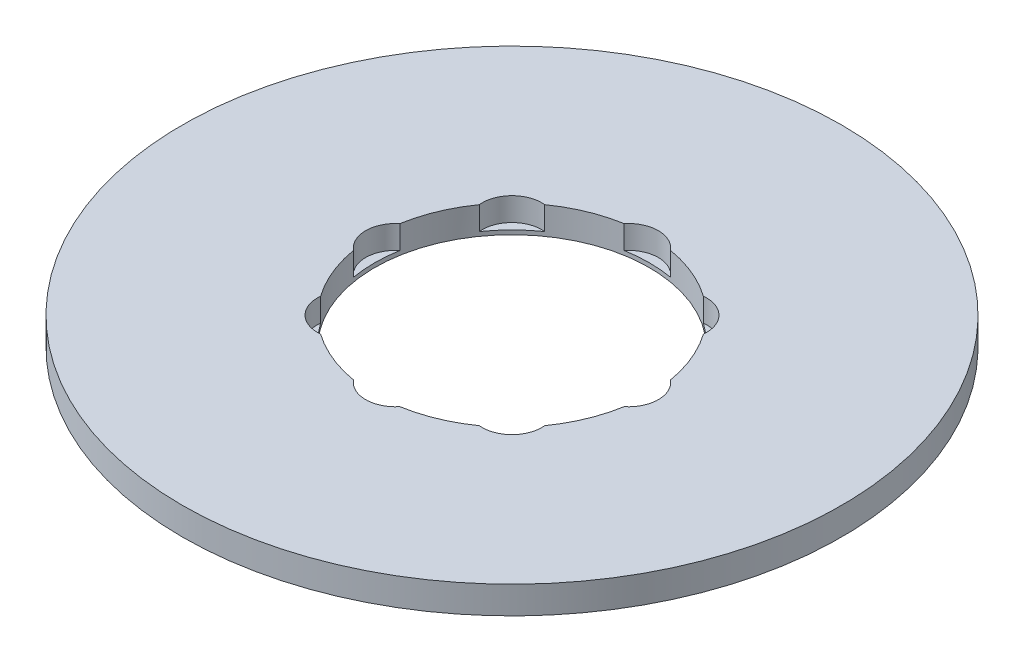
ISO-10303-21;
HEADER;
FILE_DESCRIPTION(('STEP AP214'),'2;1');
FILE_NAME('part.step','',(''),(''),'','','');
FILE_SCHEMA(('AUTOMOTIVE_DESIGN { 1 0 10303 214 1 1 1 1 }'));
ENDSEC;
DATA;
#1=APPLICATION_CONTEXT('core data for automotive mechanical design processes');
#2=APPLICATION_PROTOCOL_DEFINITION('international standard','automotive_design',2000,#1);
#3=PRODUCT_CONTEXT('',#1,'mechanical');
#4=PRODUCT('Part','Part','',(#3));
#5=PRODUCT_RELATED_PRODUCT_CATEGORY('part','',(#4));
#6=PRODUCT_DEFINITION_FORMATION('','',#4);
#7=PRODUCT_DEFINITION_CONTEXT('part definition',#1,'design');
#8=PRODUCT_DEFINITION('design','',#6,#7);
#9=PRODUCT_DEFINITION_SHAPE('','',#8);
#10=(LENGTH_UNIT() NAMED_UNIT(*) SI_UNIT(.MILLI.,.METRE.));
#11=(NAMED_UNIT(*) PLANE_ANGLE_UNIT() SI_UNIT($,.RADIAN.));
#12=(NAMED_UNIT(*) SI_UNIT($,.STERADIAN.) SOLID_ANGLE_UNIT());
#13=UNCERTAINTY_MEASURE_WITH_UNIT(LENGTH_MEASURE(1.E-05),#10,'distance_accuracy_value','');
#14=(GEOMETRIC_REPRESENTATION_CONTEXT(3) GLOBAL_UNCERTAINTY_ASSIGNED_CONTEXT((#13)) GLOBAL_UNIT_ASSIGNED_CONTEXT((#10,
#11,#12)) REPRESENTATION_CONTEXT('',''));
#15=CARTESIAN_POINT('',(0.,0.,0.));
#16=DIRECTION('',(0.,0.,1.));
#17=DIRECTION('',(1.,0.,0.));
#18=AXIS2_PLACEMENT_3D('',#15,#16,#17);
#19=CARTESIAN_POINT('',(0.,5.,0.));
#20=DIRECTION('',(0.,-1.,0.));
#21=DIRECTION('',(0.,0.,-1.));
#22=AXIS2_PLACEMENT_3D('',#19,#20,#21);
#23=CYLINDRICAL_SURFACE('',#22,60.);
#24=CARTESIAN_POINT('',(0.,5.,0.));
#25=DIRECTION('',(0.,1.,0.));
#26=DIRECTION('',(0.,0.,1.));
#27=AXIS2_PLACEMENT_3D('',#24,#25,#26);
#28=CIRCLE('',#27,60.);
#29=CARTESIAN_POINT('',(0.,5.,60.));
#30=VERTEX_POINT('',#29);
#31=EDGE_CURVE('E183',#30,#30,#28,.T.);
#32=ORIENTED_EDGE('',*,*,#31,.F.);
#33=EDGE_LOOP('',(#32));
#34=FACE_BOUND('',#33,.T.);
#35=CARTESIAN_POINT('',(0.,0.,0.));
#36=DIRECTION('',(0.,1.,0.));
#37=DIRECTION('',(0.,0.,1.));
#38=AXIS2_PLACEMENT_3D('',#35,#36,#37);
#39=CIRCLE('',#38,60.);
#40=CARTESIAN_POINT('',(0.,0.,60.));
#41=VERTEX_POINT('',#40);
#42=EDGE_CURVE('E182',#41,#41,#39,.T.);
#43=ORIENTED_EDGE('',*,*,#42,.T.);
#44=EDGE_LOOP('',(#43));
#45=FACE_BOUND('',#44,.T.);
#46=ADVANCED_FACE('F39',(#34,#45),#23,.T.);
#47=CARTESIAN_POINT('',(0.,5.,0.));
#48=DIRECTION('',(0.,1.,0.));
#49=DIRECTION('',(0.,0.,1.));
#50=AXIS2_PLACEMENT_3D('',#47,#48,#49);
#51=PLANE('',#50);
#52=CARTESIAN_POINT('',(0.,5.,21.2127378041216));
#53=DIRECTION('',(0.,1.,0.));
#54=DIRECTION('',(1.,0.,0.));
#55=AXIS2_PLACEMENT_3D('',#52,#53,#54);
#56=CIRCLE('',#55,5.4331735397557);
#57=CARTESIAN_POINT('',(-4.21397044562029,5.,24.6422899318111));
#58=VERTEX_POINT('',#57);
#59=CARTESIAN_POINT('',(4.21397044562046,5.,24.6422899318111));
#60=VERTEX_POINT('',#59);
#61=EDGE_CURVE('E256',#58,#60,#56,.T.);
#62=ORIENTED_EDGE('',*,*,#61,.F.);
#63=CARTESIAN_POINT('',(0.,5.,0.));
#64=DIRECTION('',(0.,1.,0.));
#65=DIRECTION('',(0.,0.,1.));
#66=AXIS2_PLACEMENT_3D('',#63,#64,#65);
#67=CIRCLE('',#66,25.);
#68=CARTESIAN_POINT('',(-14.4450032369307,5.,20.4044573925665));
#69=VERTEX_POINT('',#68);
#70=EDGE_CURVE('E175',#69,#58,#67,.T.);
#71=ORIENTED_EDGE('',*,*,#70,.F.);
#72=CARTESIAN_POINT('',(-14.9996707488266,5.,14.9996707488266));
#73=DIRECTION('',(0.,1.,0.));
#74=DIRECTION('',(0.707106781186549,0.,0.707106781186546));
#75=AXIS2_PLACEMENT_3D('',#72,#73,#74);
#76=CIRCLE('',#75,5.4331735397557);
#77=CARTESIAN_POINT('',(-20.4044573925664,5.,14.4450032369308));
#78=VERTEX_POINT('',#77);
#79=EDGE_CURVE('E152',#78,#69,#76,.T.);
#80=ORIENTED_EDGE('',*,*,#79,.F.);
#81=CARTESIAN_POINT('',(-24.6422899318111,5.,4.21397044562038));
#82=VERTEX_POINT('',#81);
#83=EDGE_CURVE('E168',#82,#78,#67,.T.);
#84=ORIENTED_EDGE('',*,*,#83,.F.);
#85=CARTESIAN_POINT('',(-21.2127378041216,5.,0.));
#86=DIRECTION('',(0.,1.,0.));
#87=DIRECTION('',(0.,0.,1.));
#88=AXIS2_PLACEMENT_3D('',#85,#86,#87);
#89=CIRCLE('',#88,5.4331735397557);
#90=CARTESIAN_POINT('',(-24.6422899318111,5.,-4.21397044562038));
#91=VERTEX_POINT('',#90);
#92=EDGE_CURVE('E205',#91,#82,#89,.T.);
#93=ORIENTED_EDGE('',*,*,#92,.F.);
#94=CARTESIAN_POINT('',(-20.4044573925666,5.,-14.4450032369305));
#95=VERTEX_POINT('',#94);
#96=EDGE_CURVE('E181',#95,#91,#67,.T.);
#97=ORIENTED_EDGE('',*,*,#96,.F.);
#98=CARTESIAN_POINT('',(-14.9996707488268,5.,-14.9996707488264));
#99=DIRECTION('',(0.,1.,0.));
#100=DIRECTION('',(-0.707106781186539,0.,0.707106781186556));
#101=AXIS2_PLACEMENT_3D('',#98,#99,#100);
#102=CIRCLE('',#101,5.4331735397557);
#103=CARTESIAN_POINT('',(-14.445003236931,5.,-20.4044573925663));
#104=VERTEX_POINT('',#103);
#105=EDGE_CURVE('E453',#104,#95,#102,.T.);
#106=ORIENTED_EDGE('',*,*,#105,.F.);
#107=CARTESIAN_POINT('',(-4.21397044562063,5.,-24.642289931811));
#108=VERTEX_POINT('',#107);
#109=EDGE_CURVE('E189',#108,#104,#67,.T.);
#110=ORIENTED_EDGE('',*,*,#109,.F.);
#111=CARTESIAN_POINT('',(-2.22191634566588E-13,5.,-21.2127378041216));
#112=DIRECTION('',(0.,1.,0.));
#113=DIRECTION('',(-1.,0.,0.));
#114=AXIS2_PLACEMENT_3D('',#111,#112,#113);
#115=CIRCLE('',#114,5.4331735397557);
#116=CARTESIAN_POINT('',(4.21397044562012,5.,-24.6422899318111));
#117=VERTEX_POINT('',#116);
#118=EDGE_CURVE('E462',#117,#108,#115,.T.);
#119=ORIENTED_EDGE('',*,*,#118,.F.);
#120=CARTESIAN_POINT('',(14.4450032369306,5.,-20.4044573925666));
#121=VERTEX_POINT('',#120);
#122=EDGE_CURVE('E197',#121,#117,#67,.T.);
#123=ORIENTED_EDGE('',*,*,#122,.F.);
#124=CARTESIAN_POINT('',(14.9996707488265,5.,-14.9996707488267));
#125=DIRECTION('',(0.,1.,0.));
#126=DIRECTION('',(-0.707106781186554,0.,-0.707106781186541));
#127=AXIS2_PLACEMENT_3D('',#124,#125,#126);
#128=CIRCLE('',#127,5.4331735397557);
#129=CARTESIAN_POINT('',(20.4044573925663,5.,-14.4450032369309));
#130=VERTEX_POINT('',#129);
#131=EDGE_CURVE('E470',#130,#121,#128,.T.);
#132=ORIENTED_EDGE('',*,*,#131,.F.);
#133=CARTESIAN_POINT('',(24.6422899318111,5.,-4.21397044562038));
#134=VERTEX_POINT('',#133);
#135=EDGE_CURVE('E489',#134,#130,#67,.T.);
#136=ORIENTED_EDGE('',*,*,#135,.F.);
#137=CARTESIAN_POINT('',(21.2127378041216,5.,0.));
#138=DIRECTION('',(0.,1.,0.));
#139=DIRECTION('',(0.,0.,-1.));
#140=AXIS2_PLACEMENT_3D('',#137,#138,#139);
#141=CIRCLE('',#140,5.4331735397557);
#142=CARTESIAN_POINT('',(24.6422899318111,5.,4.21397044562038));
#143=VERTEX_POINT('',#142);
#144=EDGE_CURVE('E476',#143,#134,#141,.T.);
#145=ORIENTED_EDGE('',*,*,#144,.F.);
#146=CARTESIAN_POINT('',(20.4044573925665,5.,14.4450032369306));
#147=VERTEX_POINT('',#146);
#148=EDGE_CURVE('E491',#147,#143,#67,.T.);
#149=ORIENTED_EDGE('',*,*,#148,.F.);
#150=CARTESIAN_POINT('',(14.9996707488267,5.,14.9996707488265));
#151=DIRECTION('',(0.,1.,0.));
#152=DIRECTION('',(0.707106781186544,0.,-0.707106781186551));
#153=AXIS2_PLACEMENT_3D('',#150,#151,#152);
#154=CIRCLE('',#153,5.4331735397557);
#155=CARTESIAN_POINT('',(14.4450032369308,5.,20.4044573925664));
#156=VERTEX_POINT('',#155);
#157=EDGE_CURVE('E475',#156,#147,#154,.T.);
#158=ORIENTED_EDGE('',*,*,#157,.F.);
#159=EDGE_CURVE('E190',#60,#156,#67,.T.);
#160=ORIENTED_EDGE('',*,*,#159,.F.);
#161=EDGE_LOOP('',(#62,#71,#80,#84,#93,#97,#106,#110,#119,#123,#132,#136,#145,#149,#158,#160));
#162=FACE_BOUND('',#161,.T.);
#163=ORIENTED_EDGE('',*,*,#31,.T.);
#164=EDGE_LOOP('',(#163));
#165=FACE_BOUND('',#164,.T.);
#166=ADVANCED_FACE('F170',(#162,#165),#51,.T.);
#167=CARTESIAN_POINT('',(0.,0.,0.));
#168=DIRECTION('',(0.,1.,0.));
#169=DIRECTION('',(0.,0.,1.));
#170=AXIS2_PLACEMENT_3D('',#167,#168,#169);
#171=PLANE('',#170);
#172=CARTESIAN_POINT('',(0.,0.,0.));
#173=DIRECTION('',(0.,1.,0.));
#174=DIRECTION('',(0.,0.,1.));
#175=AXIS2_PLACEMENT_3D('',#172,#173,#174);
#176=CIRCLE('',#175,25.);
#177=CARTESIAN_POINT('',(0.,0.,25.));
#178=VERTEX_POINT('',#177);
#179=EDGE_CURVE('E191',#178,#178,#176,.T.);
#180=ORIENTED_EDGE('',*,*,#179,.T.);
#181=EDGE_LOOP('',(#180));
#182=FACE_BOUND('',#181,.T.);
#183=ORIENTED_EDGE('',*,*,#42,.F.);
#184=EDGE_LOOP('',(#183));
#185=FACE_BOUND('',#184,.T.);
#186=ADVANCED_FACE('F277',(#182,#185),#171,.F.);
#187=CARTESIAN_POINT('',(0.,5.,0.));
#188=DIRECTION('',(0.,-1.,0.));
#189=DIRECTION('',(0.,0.,-1.));
#190=AXIS2_PLACEMENT_3D('',#187,#188,#189);
#191=CYLINDRICAL_SURFACE('',#190,25.);
#192=DIRECTION('',(0.,1.,0.));
#193=VECTOR('',#192,1.);
#194=CARTESIAN_POINT('',(-4.21397044562029,2.8810303567773,24.6422899318111));
#195=LINE('',#194,#193);
#196=CARTESIAN_POINT('',(-4.21397044562029,0.762060713554593,24.6422899318111));
#197=VERTEX_POINT('',#196);
#198=EDGE_CURVE('E11',#197,#58,#195,.T.);
#199=ORIENTED_EDGE('',*,*,#198,.F.);
#200=CARTESIAN_POINT('',(0.,0.762060713554593,0.));
#201=DIRECTION('',(0.,1.,0.));
#202=DIRECTION('',(0.,0.,1.));
#203=AXIS2_PLACEMENT_3D('',#200,#201,#202);
#204=CIRCLE('',#203,25.);
#205=CARTESIAN_POINT('',(4.21397044562046,0.762060713554593,24.6422899318111));
#206=VERTEX_POINT('',#205);
#207=EDGE_CURVE('E251',#197,#206,#204,.T.);
#208=ORIENTED_EDGE('',*,*,#207,.T.);
#209=DIRECTION('',(0.,1.,0.));
#210=VECTOR('',#209,1.);
#211=CARTESIAN_POINT('',(4.21397044562046,2.8810303567773,24.6422899318111));
#212=LINE('',#211,#210);
#213=EDGE_CURVE('E46',#60,#206,#212,.F.);
#214=ORIENTED_EDGE('',*,*,#213,.F.);
#215=ORIENTED_EDGE('',*,*,#159,.T.);
#216=DIRECTION('',(0.,1.,0.));
#217=VECTOR('',#216,1.);
#218=CARTESIAN_POINT('',(14.4450032369308,2.8810303567773,20.4044573925664));
#219=LINE('',#218,#217);
#220=CARTESIAN_POINT('',(14.4450032369308,0.762060713554593,20.4044573925664));
#221=VERTEX_POINT('',#220);
#222=EDGE_CURVE('E253',#221,#156,#219,.T.);
#223=ORIENTED_EDGE('',*,*,#222,.F.);
#224=CARTESIAN_POINT('',(0.,0.762060713554593,0.));
#225=DIRECTION('',(0.,1.,0.));
#226=DIRECTION('',(0.,0.,1.));
#227=AXIS2_PLACEMENT_3D('',#224,#225,#226);
#228=CIRCLE('',#227,25.);
#229=CARTESIAN_POINT('',(20.4044573925665,0.762060713554593,14.4450032369306));
#230=VERTEX_POINT('',#229);
#231=EDGE_CURVE('E246',#221,#230,#228,.T.);
#232=ORIENTED_EDGE('',*,*,#231,.T.);
#233=DIRECTION('',(0.,1.,0.));
#234=VECTOR('',#233,1.);
#235=CARTESIAN_POINT('',(20.4044573925665,2.8810303567773,14.4450032369306));
#236=LINE('',#235,#234);
#237=EDGE_CURVE('E248',#147,#230,#236,.F.);
#238=ORIENTED_EDGE('',*,*,#237,.F.);
#239=ORIENTED_EDGE('',*,*,#148,.T.);
#240=DIRECTION('',(0.,1.,0.));
#241=VECTOR('',#240,1.);
#242=CARTESIAN_POINT('',(24.6422899318111,2.8810303567773,4.21397044562038));
#243=LINE('',#242,#241);
#244=CARTESIAN_POINT('',(24.6422899318111,0.762060713554593,4.21397044562038));
#245=VERTEX_POINT('',#244);
#246=EDGE_CURVE('E243',#245,#143,#243,.T.);
#247=ORIENTED_EDGE('',*,*,#246,.F.);
#248=CARTESIAN_POINT('',(0.,0.762060713554593,0.));
#249=DIRECTION('',(0.,1.,0.));
#250=DIRECTION('',(0.,0.,1.));
#251=AXIS2_PLACEMENT_3D('',#248,#249,#250);
#252=CIRCLE('',#251,25.);
#253=CARTESIAN_POINT('',(24.6422899318111,0.762060713554593,-4.21397044562038));
#254=VERTEX_POINT('',#253);
#255=EDGE_CURVE('E236',#245,#254,#252,.T.);
#256=ORIENTED_EDGE('',*,*,#255,.T.);
#257=DIRECTION('',(0.,1.,0.));
#258=VECTOR('',#257,1.);
#259=CARTESIAN_POINT('',(24.6422899318111,2.8810303567773,-4.21397044562038));
#260=LINE('',#259,#258);
#261=EDGE_CURVE('E241',#134,#254,#260,.F.);
#262=ORIENTED_EDGE('',*,*,#261,.F.);
#263=ORIENTED_EDGE('',*,*,#135,.T.);
#264=DIRECTION('',(0.,1.,0.));
#265=VECTOR('',#264,1.);
#266=CARTESIAN_POINT('',(20.4044573925663,2.8810303567773,-14.4450032369309));
#267=LINE('',#266,#265);
#268=CARTESIAN_POINT('',(20.4044573925663,0.762060713554593,-14.4450032369309));
#269=VERTEX_POINT('',#268);
#270=EDGE_CURVE('E237',#269,#130,#267,.T.);
#271=ORIENTED_EDGE('',*,*,#270,.F.);
#272=CARTESIAN_POINT('',(0.,0.762060713554593,0.));
#273=DIRECTION('',(0.,1.,0.));
#274=DIRECTION('',(0.,0.,1.));
#275=AXIS2_PLACEMENT_3D('',#272,#273,#274);
#276=CIRCLE('',#275,25.);
#277=CARTESIAN_POINT('',(14.4450032369306,0.762060713554593,-20.4044573925666));
#278=VERTEX_POINT('',#277);
#279=EDGE_CURVE('E229',#269,#278,#276,.T.);
#280=ORIENTED_EDGE('',*,*,#279,.T.);
#281=DIRECTION('',(0.,1.,0.));
#282=VECTOR('',#281,1.);
#283=CARTESIAN_POINT('',(14.4450032369306,2.8810303567773,-20.4044573925666));
#284=LINE('',#283,#282);
#285=EDGE_CURVE('E232',#121,#278,#284,.F.);
#286=ORIENTED_EDGE('',*,*,#285,.F.);
#287=ORIENTED_EDGE('',*,*,#122,.T.);
#288=DIRECTION('',(0.,1.,0.));
#289=VECTOR('',#288,1.);
#290=CARTESIAN_POINT('',(4.21397044562012,2.8810303567773,-24.6422899318111));
#291=LINE('',#290,#289);
#292=CARTESIAN_POINT('',(4.21397044562012,0.762060713554593,-24.6422899318111));
#293=VERTEX_POINT('',#292);
#294=EDGE_CURVE('E227',#293,#117,#291,.T.);
#295=ORIENTED_EDGE('',*,*,#294,.F.);
#296=CARTESIAN_POINT('',(0.,0.762060713554593,0.));
#297=DIRECTION('',(0.,1.,0.));
#298=DIRECTION('',(0.,0.,1.));
#299=AXIS2_PLACEMENT_3D('',#296,#297,#298);
#300=CIRCLE('',#299,25.);
#301=CARTESIAN_POINT('',(-4.21397044562063,0.762060713554593,-24.642289931811));
#302=VERTEX_POINT('',#301);
#303=EDGE_CURVE('E225',#293,#302,#300,.T.);
#304=ORIENTED_EDGE('',*,*,#303,.T.);
#305=DIRECTION('',(0.,1.,0.));
#306=VECTOR('',#305,1.);
#307=CARTESIAN_POINT('',(-4.21397044562064,2.8810303567773,-24.642289931811));
#308=LINE('',#307,#306);
#309=EDGE_CURVE('E223',#108,#302,#308,.F.);
#310=ORIENTED_EDGE('',*,*,#309,.F.);
#311=ORIENTED_EDGE('',*,*,#109,.T.);
#312=DIRECTION('',(0.,1.,0.));
#313=VECTOR('',#312,1.);
#314=CARTESIAN_POINT('',(-14.445003236931,2.8810303567773,-20.4044573925663));
#315=LINE('',#314,#313);
#316=CARTESIAN_POINT('',(-14.445003236931,0.762060713554593,-20.4044573925663));
#317=VERTEX_POINT('',#316);
#318=EDGE_CURVE('E219',#317,#104,#315,.T.);
#319=ORIENTED_EDGE('',*,*,#318,.F.);
#320=CARTESIAN_POINT('',(0.,0.762060713554593,0.));
#321=DIRECTION('',(0.,1.,0.));
#322=DIRECTION('',(0.,0.,1.));
#323=AXIS2_PLACEMENT_3D('',#320,#321,#322);
#324=CIRCLE('',#323,25.);
#325=CARTESIAN_POINT('',(-20.4044573925666,0.762060713554593,-14.4450032369305));
#326=VERTEX_POINT('',#325);
#327=EDGE_CURVE('E159',#317,#326,#324,.T.);
#328=ORIENTED_EDGE('',*,*,#327,.T.);
#329=DIRECTION('',(0.,1.,0.));
#330=VECTOR('',#329,1.);
#331=CARTESIAN_POINT('',(-20.4044573925666,2.8810303567773,-14.4450032369305));
#332=LINE('',#331,#330);
#333=EDGE_CURVE('E220',#95,#326,#332,.F.);
#334=ORIENTED_EDGE('',*,*,#333,.F.);
#335=ORIENTED_EDGE('',*,*,#96,.T.);
#336=DIRECTION('',(0.,1.,0.));
#337=VECTOR('',#336,1.);
#338=CARTESIAN_POINT('',(-24.6422899318111,2.8810303567773,-4.21397044562038));
#339=LINE('',#338,#337);
#340=CARTESIAN_POINT('',(-24.6422899318111,0.762060713554593,-4.21397044562038));
#341=VERTEX_POINT('',#340);
#342=EDGE_CURVE('E209',#341,#91,#339,.T.);
#343=ORIENTED_EDGE('',*,*,#342,.F.);
#344=CARTESIAN_POINT('',(0.,0.762060713554593,0.));
#345=DIRECTION('',(0.,1.,0.));
#346=DIRECTION('',(0.,0.,1.));
#347=AXIS2_PLACEMENT_3D('',#344,#345,#346);
#348=CIRCLE('',#347,25.);
#349=CARTESIAN_POINT('',(-24.6422899318111,0.762060713554593,4.21397044562038));
#350=VERTEX_POINT('',#349);
#351=EDGE_CURVE('E206',#341,#350,#348,.T.);
#352=ORIENTED_EDGE('',*,*,#351,.T.);
#353=DIRECTION('',(0.,1.,0.));
#354=VECTOR('',#353,1.);
#355=CARTESIAN_POINT('',(-24.6422899318111,2.8810303567773,4.21397044562038));
#356=LINE('',#355,#354);
#357=EDGE_CURVE('E179',#82,#350,#356,.F.);
#358=ORIENTED_EDGE('',*,*,#357,.F.);
#359=ORIENTED_EDGE('',*,*,#83,.T.);
#360=DIRECTION('',(0.,1.,0.));
#361=VECTOR('',#360,1.);
#362=CARTESIAN_POINT('',(-20.4044573925664,2.8810303567773,14.4450032369308));
#363=LINE('',#362,#361);
#364=CARTESIAN_POINT('',(-20.4044573925664,0.762060713554593,14.4450032369308));
#365=VERTEX_POINT('',#364);
#366=EDGE_CURVE('E147',#365,#78,#363,.T.);
#367=ORIENTED_EDGE('',*,*,#366,.F.);
#368=CARTESIAN_POINT('',(0.,0.762060713554593,0.));
#369=DIRECTION('',(0.,1.,0.));
#370=DIRECTION('',(0.,0.,1.));
#371=AXIS2_PLACEMENT_3D('',#368,#369,#370);
#372=CIRCLE('',#371,25.);
#373=CARTESIAN_POINT('',(-14.4450032369307,0.762060713554593,20.4044573925665));
#374=VERTEX_POINT('',#373);
#375=EDGE_CURVE('E215',#365,#374,#372,.T.);
#376=ORIENTED_EDGE('',*,*,#375,.T.);
#377=DIRECTION('',(0.,1.,0.));
#378=VECTOR('',#377,1.);
#379=CARTESIAN_POINT('',(-14.4450032369307,2.8810303567773,20.4044573925665));
#380=LINE('',#379,#378);
#381=EDGE_CURVE('E161',#69,#374,#380,.F.);
#382=ORIENTED_EDGE('',*,*,#381,.F.);
#383=ORIENTED_EDGE('',*,*,#70,.T.);
#384=EDGE_LOOP('',(#199,#208,#214,#215,#223,#232,#238,#239,#247,#256,#262,#263,#271,#280,#286,
#287,#295,#304,#310,#311,#319,#328,#334,#335,#343,#352,#358,#359,#367,#376,#382,#383));
#385=FACE_BOUND('',#384,.T.);
#386=ORIENTED_EDGE('',*,*,#179,.F.);
#387=EDGE_LOOP('',(#386));
#388=FACE_BOUND('',#387,.T.);
#389=ADVANCED_FACE('F176',(#385,#388),#191,.F.);
#390=CARTESIAN_POINT('',(-21.2127378041216,0.762060713554593,0.));
#391=DIRECTION('',(0.,1.,0.));
#392=DIRECTION('',(0.,0.,1.));
#393=AXIS2_PLACEMENT_3D('',#390,#391,#392);
#394=CYLINDRICAL_SURFACE('',#393,5.4331735397557);
#395=ORIENTED_EDGE('',*,*,#342,.T.);
#396=ORIENTED_EDGE('',*,*,#92,.T.);
#397=ORIENTED_EDGE('',*,*,#357,.T.);
#398=CARTESIAN_POINT('',(-21.2127378041216,0.762060713554593,0.));
#399=DIRECTION('',(0.,1.,0.));
#400=DIRECTION('',(0.,0.,1.));
#401=AXIS2_PLACEMENT_3D('',#398,#399,#400);
#402=CIRCLE('',#401,5.4331735397557);
#403=EDGE_CURVE('E200',#341,#350,#402,.T.);
#404=ORIENTED_EDGE('',*,*,#403,.F.);
#405=EDGE_LOOP('',(#395,#396,#397,#404));
#406=FACE_BOUND('',#405,.T.);
#407=ADVANCED_FACE('F286',(#406),#394,.F.);
#408=CARTESIAN_POINT('',(-21.2127378041216,0.762060713554593,0.));
#409=DIRECTION('',(0.,1.,0.));
#410=DIRECTION('',(0.,0.,1.));
#411=AXIS2_PLACEMENT_3D('',#408,#409,#410);
#412=PLANE('',#411);
#413=ORIENTED_EDGE('',*,*,#403,.T.);
#414=ORIENTED_EDGE('',*,*,#351,.F.);
#415=EDGE_LOOP('',(#413,#414));
#416=FACE_BOUND('',#415,.T.);
#417=ADVANCED_FACE('F289',(#416),#412,.T.);
#418=CARTESIAN_POINT('',(-14.9996707488266,0.762060713554593,14.9996707488266));
#419=DIRECTION('',(0.,1.,0.));
#420=DIRECTION('',(0.,0.,1.));
#421=AXIS2_PLACEMENT_3D('',#418,#419,#420);
#422=CYLINDRICAL_SURFACE('',#421,5.4331735397557);
#423=ORIENTED_EDGE('',*,*,#366,.T.);
#424=ORIENTED_EDGE('',*,*,#79,.T.);
#425=ORIENTED_EDGE('',*,*,#381,.T.);
#426=CARTESIAN_POINT('',(-14.9996707488266,0.762060713554593,14.9996707488266));
#427=DIRECTION('',(0.,1.,0.));
#428=DIRECTION('',(0.707106781186549,0.,0.707106781186546));
#429=AXIS2_PLACEMENT_3D('',#426,#427,#428);
#430=CIRCLE('',#429,5.4331735397557);
#431=EDGE_CURVE('E156',#365,#374,#430,.T.);
#432=ORIENTED_EDGE('',*,*,#431,.F.);
#433=EDGE_LOOP('',(#423,#424,#425,#432));
#434=FACE_BOUND('',#433,.T.);
#435=ADVANCED_FACE('F155',(#434),#422,.F.);
#436=CARTESIAN_POINT('',(-14.9996707488266,0.762060713554593,14.9996707488266));
#437=DIRECTION('',(0.,1.,0.));
#438=DIRECTION('',(0.707106781186549,0.,0.707106781186546));
#439=AXIS2_PLACEMENT_3D('',#436,#437,#438);
#440=PLANE('',#439);
#441=ORIENTED_EDGE('',*,*,#431,.T.);
#442=ORIENTED_EDGE('',*,*,#375,.F.);
#443=EDGE_LOOP('',(#441,#442));
#444=FACE_BOUND('',#443,.T.);
#445=ADVANCED_FACE('F300',(#444),#440,.T.);
#446=CARTESIAN_POINT('',(-14.9996707488268,0.762060713554593,-14.9996707488264));
#447=DIRECTION('',(0.,1.,0.));
#448=DIRECTION('',(0.,0.,1.));
#449=AXIS2_PLACEMENT_3D('',#446,#447,#448);
#450=CYLINDRICAL_SURFACE('',#449,5.4331735397557);
#451=ORIENTED_EDGE('',*,*,#318,.T.);
#452=ORIENTED_EDGE('',*,*,#105,.T.);
#453=ORIENTED_EDGE('',*,*,#333,.T.);
#454=CARTESIAN_POINT('',(-14.9996707488268,0.762060713554593,-14.9996707488264));
#455=DIRECTION('',(0.,1.,0.));
#456=DIRECTION('',(-0.707106781186539,0.,0.707106781186556));
#457=AXIS2_PLACEMENT_3D('',#454,#455,#456);
#458=CIRCLE('',#457,5.4331735397557);
#459=EDGE_CURVE('E454',#317,#326,#458,.T.);
#460=ORIENTED_EDGE('',*,*,#459,.F.);
#461=EDGE_LOOP('',(#451,#452,#453,#460));
#462=FACE_BOUND('',#461,.T.);
#463=ADVANCED_FACE('F299',(#462),#450,.F.);
#464=CARTESIAN_POINT('',(-14.9996707488268,0.762060713554593,-14.9996707488264));
#465=DIRECTION('',(0.,1.,0.));
#466=DIRECTION('',(-0.707106781186539,0.,0.707106781186556));
#467=AXIS2_PLACEMENT_3D('',#464,#465,#466);
#468=PLANE('',#467);
#469=ORIENTED_EDGE('',*,*,#459,.T.);
#470=ORIENTED_EDGE('',*,*,#327,.F.);
#471=EDGE_LOOP('',(#469,#470));
#472=FACE_BOUND('',#471,.T.);
#473=ADVANCED_FACE('F379',(#472),#468,.T.);
#474=CARTESIAN_POINT('',(-2.22191634566588E-13,0.762060713554593,-21.2127378041216));
#475=DIRECTION('',(0.,1.,0.));
#476=DIRECTION('',(0.,0.,1.));
#477=AXIS2_PLACEMENT_3D('',#474,#475,#476);
#478=CYLINDRICAL_SURFACE('',#477,5.4331735397557);
#479=ORIENTED_EDGE('',*,*,#294,.T.);
#480=ORIENTED_EDGE('',*,*,#118,.T.);
#481=ORIENTED_EDGE('',*,*,#309,.T.);
#482=CARTESIAN_POINT('',(-2.22191634566588E-13,0.762060713554593,-21.2127378041216));
#483=DIRECTION('',(0.,1.,0.));
#484=DIRECTION('',(-1.,0.,0.));
#485=AXIS2_PLACEMENT_3D('',#482,#483,#484);
#486=CIRCLE('',#485,5.4331735397557);
#487=EDGE_CURVE('E465',#293,#302,#486,.T.);
#488=ORIENTED_EDGE('',*,*,#487,.F.);
#489=EDGE_LOOP('',(#479,#480,#481,#488));
#490=FACE_BOUND('',#489,.T.);
#491=ADVANCED_FACE('F371',(#490),#478,.F.);
#492=CARTESIAN_POINT('',(-2.22191634566588E-13,0.762060713554593,-21.2127378041216));
#493=DIRECTION('',(0.,1.,0.));
#494=DIRECTION('',(-1.,0.,0.));
#495=AXIS2_PLACEMENT_3D('',#492,#493,#494);
#496=PLANE('',#495);
#497=ORIENTED_EDGE('',*,*,#487,.T.);
#498=ORIENTED_EDGE('',*,*,#303,.F.);
#499=EDGE_LOOP('',(#497,#498));
#500=FACE_BOUND('',#499,.T.);
#501=ADVANCED_FACE('F308',(#500),#496,.T.);
#502=CARTESIAN_POINT('',(14.9996707488265,0.762060713554593,-14.9996707488267));
#503=DIRECTION('',(0.,1.,0.));
#504=DIRECTION('',(0.,0.,1.));
#505=AXIS2_PLACEMENT_3D('',#502,#503,#504);
#506=CYLINDRICAL_SURFACE('',#505,5.4331735397557);
#507=ORIENTED_EDGE('',*,*,#270,.T.);
#508=ORIENTED_EDGE('',*,*,#131,.T.);
#509=ORIENTED_EDGE('',*,*,#285,.T.);
#510=CARTESIAN_POINT('',(14.9996707488265,0.762060713554593,-14.9996707488267));
#511=DIRECTION('',(0.,1.,0.));
#512=DIRECTION('',(-0.707106781186554,0.,-0.707106781186541));
#513=AXIS2_PLACEMENT_3D('',#510,#511,#512);
#514=CIRCLE('',#513,5.4331735397557);
#515=EDGE_CURVE('E477',#269,#278,#514,.T.);
#516=ORIENTED_EDGE('',*,*,#515,.F.);
#517=EDGE_LOOP('',(#507,#508,#509,#516));
#518=FACE_BOUND('',#517,.T.);
#519=ADVANCED_FACE('F305',(#518),#506,.F.);
#520=CARTESIAN_POINT('',(14.9996707488265,0.762060713554593,-14.9996707488267));
#521=DIRECTION('',(0.,1.,0.));
#522=DIRECTION('',(-0.707106781186554,0.,-0.707106781186541));
#523=AXIS2_PLACEMENT_3D('',#520,#521,#522);
#524=PLANE('',#523);
#525=ORIENTED_EDGE('',*,*,#515,.T.);
#526=ORIENTED_EDGE('',*,*,#279,.F.);
#527=EDGE_LOOP('',(#525,#526));
#528=FACE_BOUND('',#527,.T.);
#529=ADVANCED_FACE('F304',(#528),#524,.T.);
#530=CARTESIAN_POINT('',(21.2127378041216,0.762060713554593,0.));
#531=DIRECTION('',(0.,1.,0.));
#532=DIRECTION('',(0.,0.,1.));
#533=AXIS2_PLACEMENT_3D('',#530,#531,#532);
#534=CYLINDRICAL_SURFACE('',#533,5.4331735397557);
#535=ORIENTED_EDGE('',*,*,#246,.T.);
#536=ORIENTED_EDGE('',*,*,#144,.T.);
#537=ORIENTED_EDGE('',*,*,#261,.T.);
#538=CARTESIAN_POINT('',(21.2127378041216,0.762060713554593,0.));
#539=DIRECTION('',(0.,1.,0.));
#540=DIRECTION('',(0.,0.,-1.));
#541=AXIS2_PLACEMENT_3D('',#538,#539,#540);
#542=CIRCLE('',#541,5.4331735397557);
#543=EDGE_CURVE('E478',#245,#254,#542,.T.);
#544=ORIENTED_EDGE('',*,*,#543,.F.);
#545=EDGE_LOOP('',(#535,#536,#537,#544));
#546=FACE_BOUND('',#545,.T.);
#547=ADVANCED_FACE('F309',(#546),#534,.F.);
#548=CARTESIAN_POINT('',(21.2127378041216,0.762060713554593,0.));
#549=DIRECTION('',(0.,1.,0.));
#550=DIRECTION('',(0.,0.,-1.));
#551=AXIS2_PLACEMENT_3D('',#548,#549,#550);
#552=PLANE('',#551);
#553=ORIENTED_EDGE('',*,*,#543,.T.);
#554=ORIENTED_EDGE('',*,*,#255,.F.);
#555=EDGE_LOOP('',(#553,#554));
#556=FACE_BOUND('',#555,.T.);
#557=ADVANCED_FACE('F314',(#556),#552,.T.);
#558=CARTESIAN_POINT('',(14.9996707488267,0.762060713554593,14.9996707488265));
#559=DIRECTION('',(0.,1.,0.));
#560=DIRECTION('',(0.,0.,1.));
#561=AXIS2_PLACEMENT_3D('',#558,#559,#560);
#562=CYLINDRICAL_SURFACE('',#561,5.4331735397557);
#563=ORIENTED_EDGE('',*,*,#222,.T.);
#564=ORIENTED_EDGE('',*,*,#157,.T.);
#565=ORIENTED_EDGE('',*,*,#237,.T.);
#566=CARTESIAN_POINT('',(14.9996707488267,0.762060713554593,14.9996707488265));
#567=DIRECTION('',(0.,1.,0.));
#568=DIRECTION('',(0.707106781186544,0.,-0.707106781186551));
#569=AXIS2_PLACEMENT_3D('',#566,#567,#568);
#570=CIRCLE('',#569,5.4331735397557);
#571=EDGE_CURVE('E56',#221,#230,#570,.T.);
#572=ORIENTED_EDGE('',*,*,#571,.F.);
#573=EDGE_LOOP('',(#563,#564,#565,#572));
#574=FACE_BOUND('',#573,.T.);
#575=ADVANCED_FACE('F318',(#574),#562,.F.);
#576=CARTESIAN_POINT('',(14.9996707488267,0.762060713554593,14.9996707488265));
#577=DIRECTION('',(0.,1.,0.));
#578=DIRECTION('',(0.707106781186544,0.,-0.707106781186551));
#579=AXIS2_PLACEMENT_3D('',#576,#577,#578);
#580=PLANE('',#579);
#581=ORIENTED_EDGE('',*,*,#571,.T.);
#582=ORIENTED_EDGE('',*,*,#231,.F.);
#583=EDGE_LOOP('',(#581,#582));
#584=FACE_BOUND('',#583,.T.);
#585=ADVANCED_FACE('F270',(#584),#580,.T.);
#586=CARTESIAN_POINT('',(0.,0.762060713554593,21.2127378041216));
#587=DIRECTION('',(0.,1.,0.));
#588=DIRECTION('',(0.,0.,1.));
#589=AXIS2_PLACEMENT_3D('',#586,#587,#588);
#590=CYLINDRICAL_SURFACE('',#589,5.4331735397557);
#591=ORIENTED_EDGE('',*,*,#198,.T.);
#592=ORIENTED_EDGE('',*,*,#61,.T.);
#593=ORIENTED_EDGE('',*,*,#213,.T.);
#594=CARTESIAN_POINT('',(0.,0.762060713554593,21.2127378041216));
#595=DIRECTION('',(0.,1.,0.));
#596=DIRECTION('',(1.,0.,0.));
#597=AXIS2_PLACEMENT_3D('',#594,#595,#596);
#598=CIRCLE('',#597,5.4331735397557);
#599=EDGE_CURVE('E55',#197,#206,#598,.T.);
#600=ORIENTED_EDGE('',*,*,#599,.F.);
#601=EDGE_LOOP('',(#591,#592,#593,#600));
#602=FACE_BOUND('',#601,.T.);
#603=ADVANCED_FACE('F260',(#602),#590,.F.);
#604=CARTESIAN_POINT('',(0.,0.762060713554593,21.2127378041216));
#605=DIRECTION('',(0.,1.,0.));
#606=DIRECTION('',(1.,0.,0.));
#607=AXIS2_PLACEMENT_3D('',#604,#605,#606);
#608=PLANE('',#607);
#609=ORIENTED_EDGE('',*,*,#599,.T.);
#610=ORIENTED_EDGE('',*,*,#207,.F.);
#611=EDGE_LOOP('',(#609,#610));
#612=FACE_BOUND('',#611,.T.);
#613=ADVANCED_FACE('F261',(#612),#608,.T.);
#614=CLOSED_SHELL('',(#46,#166,#186,#389,#407,#417,#435,#445,#463,#473,#491,#501,#519,#529,#547,
#557,#575,#585,#603,#613));
#615=MANIFOLD_SOLID_BREP('B2',#614);
#616=ADVANCED_BREP_SHAPE_REPRESENTATION('',(#18,#615),#14);
#617=SHAPE_DEFINITION_REPRESENTATION(#9,#616);
ENDSEC;
END-ISO-10303-21;
